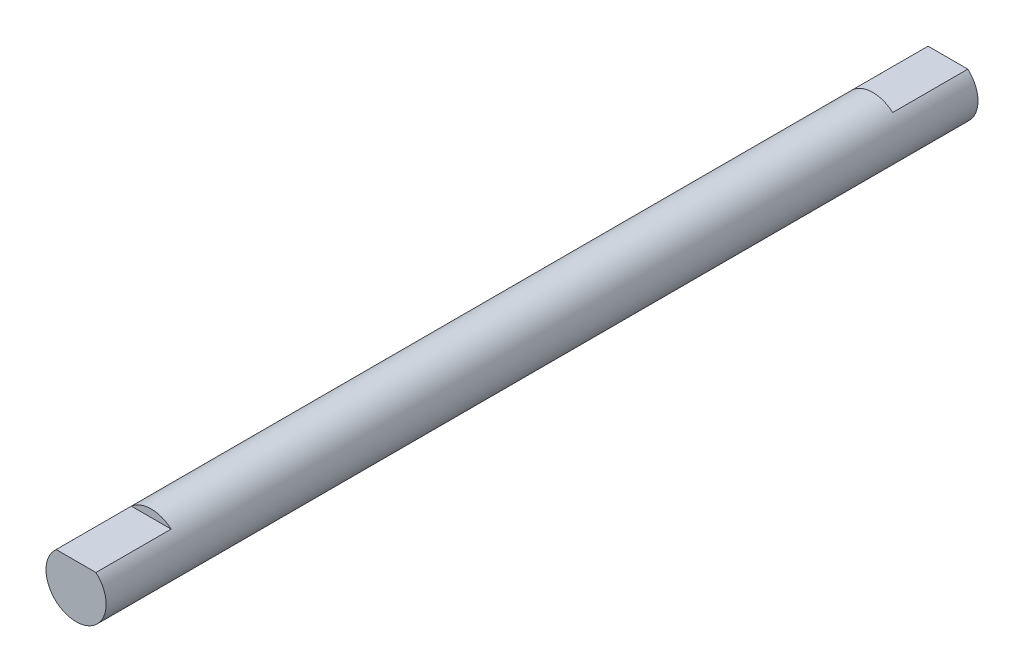
ISO-10303-21;
HEADER;
FILE_DESCRIPTION(('STEP AP214'),'2;1');
FILE_NAME('part.step','',(''),(''),'','','');
FILE_SCHEMA(('AUTOMOTIVE_DESIGN { 1 0 10303 214 1 1 1 1 }'));
ENDSEC;
DATA;
#1=APPLICATION_CONTEXT('core data for automotive mechanical design processes');
#2=APPLICATION_PROTOCOL_DEFINITION('international standard','automotive_design',2000,#1);
#3=PRODUCT_CONTEXT('',#1,'mechanical');
#4=PRODUCT('Part','Part','',(#3));
#5=PRODUCT_RELATED_PRODUCT_CATEGORY('part','',(#4));
#6=PRODUCT_DEFINITION_FORMATION('','',#4);
#7=PRODUCT_DEFINITION_CONTEXT('part definition',#1,'design');
#8=PRODUCT_DEFINITION('design','',#6,#7);
#9=PRODUCT_DEFINITION_SHAPE('','',#8);
#10=(LENGTH_UNIT() NAMED_UNIT(*) SI_UNIT(.MILLI.,.METRE.));
#11=(NAMED_UNIT(*) PLANE_ANGLE_UNIT() SI_UNIT($,.RADIAN.));
#12=(NAMED_UNIT(*) SI_UNIT($,.STERADIAN.) SOLID_ANGLE_UNIT());
#13=UNCERTAINTY_MEASURE_WITH_UNIT(LENGTH_MEASURE(1.E-05),#10,'distance_accuracy_value','');
#14=(GEOMETRIC_REPRESENTATION_CONTEXT(3) GLOBAL_UNCERTAINTY_ASSIGNED_CONTEXT((#13)) GLOBAL_UNIT_ASSIGNED_CONTEXT((#10,
#11,#12)) REPRESENTATION_CONTEXT('',''));
#15=CARTESIAN_POINT('',(0.,0.,0.));
#16=DIRECTION('',(0.,0.,1.));
#17=DIRECTION('',(1.,0.,0.));
#18=AXIS2_PLACEMENT_3D('',#15,#16,#17);
#19=CARTESIAN_POINT('',(0.,0.,-58.));
#20=DIRECTION('',(0.,0.,1.));
#21=DIRECTION('',(1.,0.,0.));
#22=AXIS2_PLACEMENT_3D('',#19,#20,#21);
#23=CYLINDRICAL_SURFACE('',#22,4.);
#24=DIRECTION('',(0.,0.,1.));
#25=VECTOR('',#24,1.);
#26=CARTESIAN_POINT('',(2.64575131106459,3.,48.));
#27=LINE('',#26,#25);
#28=CARTESIAN_POINT('',(2.64575131106459,3.,48.));
#29=VERTEX_POINT('',#28);
#30=CARTESIAN_POINT('',(2.64575131106459,3.,58.));
#31=VERTEX_POINT('',#30);
#32=EDGE_CURVE('E113',#29,#31,#27,.T.);
#33=ORIENTED_EDGE('',*,*,#32,.T.);
#34=CARTESIAN_POINT('',(0.,0.,58.));
#35=DIRECTION('',(0.,0.,1.));
#36=DIRECTION('',(1.,0.,0.));
#37=AXIS2_PLACEMENT_3D('',#34,#35,#36);
#38=CIRCLE('',#37,4.);
#39=CARTESIAN_POINT('',(-2.64575131106459,3.,58.));
#40=VERTEX_POINT('',#39);
#41=EDGE_CURVE('E48',#40,#31,#38,.T.);
#42=ORIENTED_EDGE('',*,*,#41,.F.);
#43=DIRECTION('',(0.,0.,1.));
#44=VECTOR('',#43,1.);
#45=CARTESIAN_POINT('',(-2.64575131106459,3.,48.));
#46=LINE('',#45,#44);
#47=CARTESIAN_POINT('',(-2.64575131106459,3.,48.));
#48=VERTEX_POINT('',#47);
#49=EDGE_CURVE('E63',#48,#40,#46,.T.);
#50=ORIENTED_EDGE('',*,*,#49,.F.);
#51=CARTESIAN_POINT('',(0.,0.,48.));
#52=DIRECTION('',(0.,0.,1.));
#53=DIRECTION('',(1.,0.,0.));
#54=AXIS2_PLACEMENT_3D('',#51,#52,#53);
#55=CIRCLE('',#54,4.);
#56=EDGE_CURVE('E104',#29,#48,#55,.T.);
#57=ORIENTED_EDGE('',*,*,#56,.F.);
#58=EDGE_LOOP('',(#33,#42,#50,#57));
#59=FACE_BOUND('',#58,.T.);
#60=CARTESIAN_POINT('',(0.,0.,-48.));
#61=DIRECTION('',(0.,0.,1.));
#62=DIRECTION('',(1.,0.,0.));
#63=AXIS2_PLACEMENT_3D('',#60,#61,#62);
#64=CIRCLE('',#63,4.);
#65=CARTESIAN_POINT('',(2.64575131106459,3.,-48.));
#66=VERTEX_POINT('',#65);
#67=CARTESIAN_POINT('',(-2.64575131106459,3.,-48.));
#68=VERTEX_POINT('',#67);
#69=EDGE_CURVE('E88',#66,#68,#64,.T.);
#70=ORIENTED_EDGE('',*,*,#69,.T.);
#71=DIRECTION('',(0.,0.,-1.));
#72=VECTOR('',#71,1.);
#73=CARTESIAN_POINT('',(-2.64575131106459,3.,-48.));
#74=LINE('',#73,#72);
#75=CARTESIAN_POINT('',(-2.64575131106459,3.,-58.));
#76=VERTEX_POINT('',#75);
#77=EDGE_CURVE('E84',#68,#76,#74,.T.);
#78=ORIENTED_EDGE('',*,*,#77,.T.);
#79=CARTESIAN_POINT('',(0.,0.,-58.));
#80=DIRECTION('',(0.,0.,1.));
#81=DIRECTION('',(1.,0.,0.));
#82=AXIS2_PLACEMENT_3D('',#79,#80,#81);
#83=CIRCLE('',#82,4.);
#84=CARTESIAN_POINT('',(2.64575131106459,3.,-58.));
#85=VERTEX_POINT('',#84);
#86=EDGE_CURVE('E11',#76,#85,#83,.T.);
#87=ORIENTED_EDGE('',*,*,#86,.T.);
#88=DIRECTION('',(0.,0.,-1.));
#89=VECTOR('',#88,1.);
#90=CARTESIAN_POINT('',(2.64575131106459,3.,-48.));
#91=LINE('',#90,#89);
#92=EDGE_CURVE('E55',#66,#85,#91,.T.);
#93=ORIENTED_EDGE('',*,*,#92,.F.);
#94=EDGE_LOOP('',(#70,#78,#87,#93));
#95=FACE_BOUND('',#94,.T.);
#96=ADVANCED_FACE('F40',(#59,#95),#23,.T.);
#97=CARTESIAN_POINT('',(0.,0.,-58.));
#98=DIRECTION('',(0.,0.,1.));
#99=DIRECTION('',(1.,0.,0.));
#100=AXIS2_PLACEMENT_3D('',#97,#98,#99);
#101=PLANE('',#100);
#102=DIRECTION('',(1.,0.,0.));
#103=VECTOR('',#102,1.);
#104=CARTESIAN_POINT('',(2.64575131106459,3.,-58.));
#105=LINE('',#104,#103);
#106=EDGE_CURVE('E93',#76,#85,#105,.T.);
#107=ORIENTED_EDGE('',*,*,#106,.T.);
#108=ORIENTED_EDGE('',*,*,#86,.F.);
#109=EDGE_LOOP('',(#107,#108));
#110=FACE_BOUND('',#109,.T.);
#111=ADVANCED_FACE('F138',(#110),#101,.F.);
#112=CARTESIAN_POINT('',(0.,0.,58.));
#113=DIRECTION('',(0.,0.,1.));
#114=DIRECTION('',(1.,0.,0.));
#115=AXIS2_PLACEMENT_3D('',#112,#113,#114);
#116=PLANE('',#115);
#117=DIRECTION('',(1.,0.,0.));
#118=VECTOR('',#117,1.);
#119=CARTESIAN_POINT('',(2.64575131106459,3.,58.));
#120=LINE('',#119,#118);
#121=EDGE_CURVE('E100',#40,#31,#120,.T.);
#122=ORIENTED_EDGE('',*,*,#121,.F.);
#123=ORIENTED_EDGE('',*,*,#41,.T.);
#124=EDGE_LOOP('',(#122,#123));
#125=FACE_BOUND('',#124,.T.);
#126=ADVANCED_FACE('F123',(#125),#116,.T.);
#127=CARTESIAN_POINT('',(2.64575131106459,3.,48.));
#128=DIRECTION('',(0.,-1.,0.));
#129=DIRECTION('',(1.,0.,0.));
#130=AXIS2_PLACEMENT_3D('',#127,#128,#129);
#131=PLANE('',#130);
#132=ORIENTED_EDGE('',*,*,#121,.T.);
#133=ORIENTED_EDGE('',*,*,#32,.F.);
#134=DIRECTION('',(1.,0.,0.));
#135=VECTOR('',#134,1.);
#136=CARTESIAN_POINT('',(2.64575131106459,3.,48.));
#137=LINE('',#136,#135);
#138=EDGE_CURVE('E107',#48,#29,#137,.T.);
#139=ORIENTED_EDGE('',*,*,#138,.F.);
#140=ORIENTED_EDGE('',*,*,#49,.T.);
#141=EDGE_LOOP('',(#132,#133,#139,#140));
#142=FACE_BOUND('',#141,.T.);
#143=ADVANCED_FACE('F126',(#142),#131,.F.);
#144=CARTESIAN_POINT('',(0.,0.,48.));
#145=DIRECTION('',(0.,0.,1.));
#146=DIRECTION('',(1.,0.,0.));
#147=AXIS2_PLACEMENT_3D('',#144,#145,#146);
#148=PLANE('',#147);
#149=ORIENTED_EDGE('',*,*,#56,.T.);
#150=ORIENTED_EDGE('',*,*,#138,.T.);
#151=EDGE_LOOP('',(#149,#150));
#152=FACE_BOUND('',#151,.T.);
#153=ADVANCED_FACE('F128',(#152),#148,.T.);
#154=CARTESIAN_POINT('',(2.64575131106459,3.,-48.));
#155=DIRECTION('',(0.,1.,0.));
#156=DIRECTION('',(-1.,0.,0.));
#157=AXIS2_PLACEMENT_3D('',#154,#155,#156);
#158=PLANE('',#157);
#159=ORIENTED_EDGE('',*,*,#106,.F.);
#160=ORIENTED_EDGE('',*,*,#77,.F.);
#161=DIRECTION('',(1.,0.,0.));
#162=VECTOR('',#161,1.);
#163=CARTESIAN_POINT('',(2.64575131106459,3.,-48.));
#164=LINE('',#163,#162);
#165=EDGE_CURVE('E80',#68,#66,#164,.T.);
#166=ORIENTED_EDGE('',*,*,#165,.T.);
#167=ORIENTED_EDGE('',*,*,#92,.T.);
#168=EDGE_LOOP('',(#159,#160,#166,#167));
#169=FACE_BOUND('',#168,.T.);
#170=ADVANCED_FACE('F82',(#169),#158,.T.);
#171=CARTESIAN_POINT('',(0.,0.,-48.));
#172=DIRECTION('',(0.,0.,-1.));
#173=DIRECTION('',(1.,0.,0.));
#174=AXIS2_PLACEMENT_3D('',#171,#172,#173);
#175=PLANE('',#174);
#176=ORIENTED_EDGE('',*,*,#69,.F.);
#177=ORIENTED_EDGE('',*,*,#165,.F.);
#178=EDGE_LOOP('',(#176,#177));
#179=FACE_BOUND('',#178,.T.);
#180=ADVANCED_FACE('F90',(#179),#175,.T.);
#181=CLOSED_SHELL('',(#96,#111,#126,#143,#153,#170,#180));
#182=MANIFOLD_SOLID_BREP('B2',#181);
#183=ADVANCED_BREP_SHAPE_REPRESENTATION('',(#18,#182),#14);
#184=SHAPE_DEFINITION_REPRESENTATION(#9,#183);
ENDSEC;
END-ISO-10303-21;
